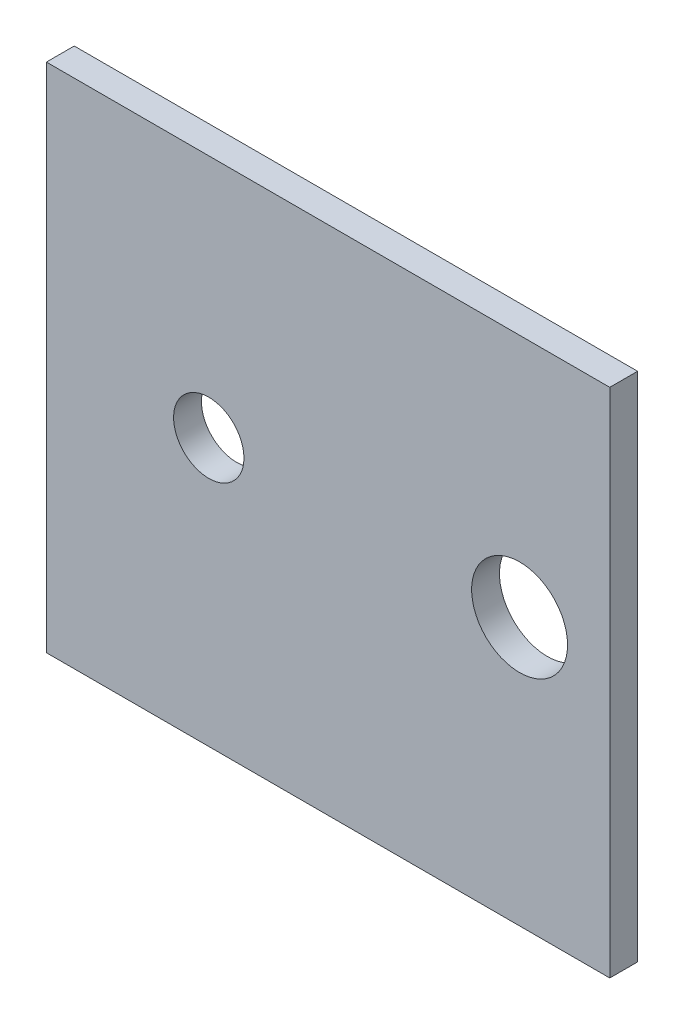
ISO-10303-21;
HEADER;
FILE_DESCRIPTION(('STEP AP214'),'2;1');
FILE_NAME('part.step','',(''),(''),'','','');
FILE_SCHEMA(('AUTOMOTIVE_DESIGN { 1 0 10303 214 1 1 1 1 }'));
ENDSEC;
DATA;
#1=APPLICATION_CONTEXT('core data for automotive mechanical design processes');
#2=APPLICATION_PROTOCOL_DEFINITION('international standard','automotive_design',2000,#1);
#3=PRODUCT_CONTEXT('',#1,'mechanical');
#4=PRODUCT('Part','Part','',(#3));
#5=PRODUCT_RELATED_PRODUCT_CATEGORY('part','',(#4));
#6=PRODUCT_DEFINITION_FORMATION('','',#4);
#7=PRODUCT_DEFINITION_CONTEXT('part definition',#1,'design');
#8=PRODUCT_DEFINITION('design','',#6,#7);
#9=PRODUCT_DEFINITION_SHAPE('','',#8);
#10=(LENGTH_UNIT() NAMED_UNIT(*) SI_UNIT(.MILLI.,.METRE.));
#11=(NAMED_UNIT(*) PLANE_ANGLE_UNIT() SI_UNIT($,.RADIAN.));
#12=(NAMED_UNIT(*) SI_UNIT($,.STERADIAN.) SOLID_ANGLE_UNIT());
#13=UNCERTAINTY_MEASURE_WITH_UNIT(LENGTH_MEASURE(1.E-05),#10,'distance_accuracy_value','');
#14=(GEOMETRIC_REPRESENTATION_CONTEXT(3) GLOBAL_UNCERTAINTY_ASSIGNED_CONTEXT((#13)) GLOBAL_UNIT_ASSIGNED_CONTEXT((#10,
#11,#12)) REPRESENTATION_CONTEXT('',''));
#15=CARTESIAN_POINT('',(0.,0.,0.));
#16=DIRECTION('',(0.,0.,1.));
#17=DIRECTION('',(1.,0.,0.));
#18=AXIS2_PLACEMENT_3D('',#15,#16,#17);
#19=CARTESIAN_POINT('',(-54.8277353652689,48.1512235817575,4.35));
#20=DIRECTION('',(1.,0.,0.));
#21=DIRECTION('',(0.,1.,0.));
#22=AXIS2_PLACEMENT_3D('',#19,#20,#21);
#23=PLANE('',#22);
#24=DIRECTION('',(0.,-1.,0.));
#25=VECTOR('',#24,1.);
#26=CARTESIAN_POINT('',(-54.8277353652689,48.1512235817575,0.));
#27=LINE('',#26,#25);
#28=CARTESIAN_POINT('',(-54.8277353652689,48.1512235817575,0.));
#29=VERTEX_POINT('',#28);
#30=CARTESIAN_POINT('',(-54.8277353652689,-31.8487764182425,0.));
#31=VERTEX_POINT('',#30);
#32=EDGE_CURVE('E107',#29,#31,#27,.T.);
#33=ORIENTED_EDGE('',*,*,#32,.T.);
#34=DIRECTION('',(0.,0.,-1.));
#35=VECTOR('',#34,1.);
#36=CARTESIAN_POINT('',(-54.8277353652689,-31.8487764182425,4.35));
#37=LINE('',#36,#35);
#38=CARTESIAN_POINT('',(-54.8277353652689,-31.8487764182425,4.35));
#39=VERTEX_POINT('',#38);
#40=EDGE_CURVE('E11',#39,#31,#37,.T.);
#41=ORIENTED_EDGE('',*,*,#40,.F.);
#42=DIRECTION('',(0.,-1.,0.));
#43=VECTOR('',#42,1.);
#44=CARTESIAN_POINT('',(-54.8277353652689,48.1512235817575,4.35));
#45=LINE('',#44,#43);
#46=CARTESIAN_POINT('',(-54.8277353652689,48.1512235817575,4.35));
#47=VERTEX_POINT('',#46);
#48=EDGE_CURVE('E91',#47,#39,#45,.T.);
#49=ORIENTED_EDGE('',*,*,#48,.F.);
#50=DIRECTION('',(0.,0.,-1.));
#51=VECTOR('',#50,1.);
#52=CARTESIAN_POINT('',(-54.8277353652689,48.1512235817575,4.35));
#53=LINE('',#52,#51);
#54=EDGE_CURVE('E103',#47,#29,#53,.T.);
#55=ORIENTED_EDGE('',*,*,#54,.T.);
#56=EDGE_LOOP('',(#33,#41,#49,#55));
#57=FACE_BOUND('',#56,.T.);
#58=ADVANCED_FACE('F39',(#57),#23,.F.);
#59=CARTESIAN_POINT('',(-54.8277353652689,-31.8487764182425,4.35));
#60=DIRECTION('',(0.,1.,0.));
#61=DIRECTION('',(0.,0.,1.));
#62=AXIS2_PLACEMENT_3D('',#59,#60,#61);
#63=PLANE('',#62);
#64=DIRECTION('',(1.,0.,0.));
#65=VECTOR('',#64,1.);
#66=CARTESIAN_POINT('',(-54.8277353652689,-31.8487764182425,0.));
#67=LINE('',#66,#65);
#68=CARTESIAN_POINT('',(33.2722646347311,-31.8487764182425,0.));
#69=VERTEX_POINT('',#68);
#70=EDGE_CURVE('E96',#31,#69,#67,.T.);
#71=ORIENTED_EDGE('',*,*,#70,.T.);
#72=DIRECTION('',(0.,0.,-1.));
#73=VECTOR('',#72,1.);
#74=CARTESIAN_POINT('',(33.2722646347311,-31.8487764182425,4.35));
#75=LINE('',#74,#73);
#76=CARTESIAN_POINT('',(33.2722646347311,-31.8487764182425,4.35));
#77=VERTEX_POINT('',#76);
#78=EDGE_CURVE('E48',#77,#69,#75,.T.);
#79=ORIENTED_EDGE('',*,*,#78,.F.);
#80=DIRECTION('',(1.,0.,0.));
#81=VECTOR('',#80,1.);
#82=CARTESIAN_POINT('',(-54.8277353652689,-31.8487764182425,4.35));
#83=LINE('',#82,#81);
#84=EDGE_CURVE('E86',#39,#77,#83,.T.);
#85=ORIENTED_EDGE('',*,*,#84,.F.);
#86=ORIENTED_EDGE('',*,*,#40,.T.);
#87=EDGE_LOOP('',(#71,#79,#85,#86));
#88=FACE_BOUND('',#87,.T.);
#89=ADVANCED_FACE('F95',(#88),#63,.F.);
#90=CARTESIAN_POINT('',(33.2722646347311,48.1512235817575,4.35));
#91=DIRECTION('',(-1.,0.,0.));
#92=DIRECTION('',(0.,-1.,0.));
#93=AXIS2_PLACEMENT_3D('',#90,#91,#92);
#94=PLANE('',#93);
#95=DIRECTION('',(0.,1.,0.));
#96=VECTOR('',#95,1.);
#97=CARTESIAN_POINT('',(33.2722646347311,48.1512235817575,0.));
#98=LINE('',#97,#96);
#99=CARTESIAN_POINT('',(33.2722646347311,48.1512235817575,0.));
#100=VERTEX_POINT('',#99);
#101=EDGE_CURVE('E73',#69,#100,#98,.T.);
#102=ORIENTED_EDGE('',*,*,#101,.T.);
#103=DIRECTION('',(0.,0.,-1.));
#104=VECTOR('',#103,1.);
#105=CARTESIAN_POINT('',(33.2722646347311,48.1512235817575,4.35));
#106=LINE('',#105,#104);
#107=CARTESIAN_POINT('',(33.2722646347311,48.1512235817575,4.35));
#108=VERTEX_POINT('',#107);
#109=EDGE_CURVE('E98',#108,#100,#106,.T.);
#110=ORIENTED_EDGE('',*,*,#109,.F.);
#111=DIRECTION('',(0.,1.,0.));
#112=VECTOR('',#111,1.);
#113=CARTESIAN_POINT('',(33.2722646347311,48.1512235817575,4.35));
#114=LINE('',#113,#112);
#115=EDGE_CURVE('E89',#77,#108,#114,.T.);
#116=ORIENTED_EDGE('',*,*,#115,.F.);
#117=ORIENTED_EDGE('',*,*,#78,.T.);
#118=EDGE_LOOP('',(#102,#110,#116,#117));
#119=FACE_BOUND('',#118,.T.);
#120=ADVANCED_FACE('F99',(#119),#94,.F.);
#121=CARTESIAN_POINT('',(-54.8277353652689,48.1512235817575,4.35));
#122=DIRECTION('',(0.,-1.,0.));
#123=DIRECTION('',(0.,0.,-1.));
#124=AXIS2_PLACEMENT_3D('',#121,#122,#123);
#125=PLANE('',#124);
#126=DIRECTION('',(-1.,0.,0.));
#127=VECTOR('',#126,1.);
#128=CARTESIAN_POINT('',(-54.8277353652689,48.1512235817575,0.));
#129=LINE('',#128,#127);
#130=EDGE_CURVE('E79',#100,#29,#129,.T.);
#131=ORIENTED_EDGE('',*,*,#130,.T.);
#132=ORIENTED_EDGE('',*,*,#54,.F.);
#133=DIRECTION('',(-1.,0.,0.));
#134=VECTOR('',#133,1.);
#135=CARTESIAN_POINT('',(-54.8277353652689,48.1512235817575,4.35));
#136=LINE('',#135,#134);
#137=EDGE_CURVE('E56',#108,#47,#136,.T.);
#138=ORIENTED_EDGE('',*,*,#137,.F.);
#139=ORIENTED_EDGE('',*,*,#109,.T.);
#140=EDGE_LOOP('',(#131,#132,#138,#139));
#141=FACE_BOUND('',#140,.T.);
#142=ADVANCED_FACE('F121',(#141),#125,.F.);
#143=CARTESIAN_POINT('',(0.,0.,4.35));
#144=DIRECTION('',(0.,0.,1.));
#145=DIRECTION('',(1.,0.,0.));
#146=AXIS2_PLACEMENT_3D('',#143,#144,#145);
#147=PLANE('',#146);
#148=CARTESIAN_POINT('',(19.1722646347311,9.96122358175752,4.35));
#149=DIRECTION('',(0.,0.,1.));
#150=DIRECTION('',(1.,0.,0.));
#151=AXIS2_PLACEMENT_3D('',#148,#149,#150);
#152=CIRCLE('',#151,7.5);
#153=CARTESIAN_POINT('',(26.6722646347311,9.96122358175752,4.35));
#154=VERTEX_POINT('',#153);
#155=EDGE_CURVE('E136',#154,#154,#152,.T.);
#156=ORIENTED_EDGE('',*,*,#155,.F.);
#157=EDGE_LOOP('',(#156));
#158=FACE_BOUND('',#157,.T.);
#159=CARTESIAN_POINT('',(-29.4377353652689,9.96122358175752,4.35));
#160=DIRECTION('',(0.,0.,1.));
#161=DIRECTION('',(1.,0.,0.));
#162=AXIS2_PLACEMENT_3D('',#159,#160,#161);
#163=CIRCLE('',#162,5.5);
#164=CARTESIAN_POINT('',(-23.9377353652689,9.96122358175752,4.35));
#165=VERTEX_POINT('',#164);
#166=EDGE_CURVE('E128',#165,#165,#163,.T.);
#167=ORIENTED_EDGE('',*,*,#166,.F.);
#168=EDGE_LOOP('',(#167));
#169=FACE_BOUND('',#168,.T.);
#170=ORIENTED_EDGE('',*,*,#48,.T.);
#171=ORIENTED_EDGE('',*,*,#84,.T.);
#172=ORIENTED_EDGE('',*,*,#115,.T.);
#173=ORIENTED_EDGE('',*,*,#137,.T.);
#174=EDGE_LOOP('',(#170,#171,#172,#173));
#175=FACE_BOUND('',#174,.T.);
#176=ADVANCED_FACE('F87',(#158,#169,#175),#147,.T.);
#177=CARTESIAN_POINT('',(0.,0.,0.));
#178=DIRECTION('',(0.,0.,1.));
#179=DIRECTION('',(1.,0.,0.));
#180=AXIS2_PLACEMENT_3D('',#177,#178,#179);
#181=PLANE('',#180);
#182=CARTESIAN_POINT('',(19.1722646347311,9.96122358175752,0.));
#183=DIRECTION('',(0.,0.,1.));
#184=DIRECTION('',(1.,0.,0.));
#185=AXIS2_PLACEMENT_3D('',#182,#183,#184);
#186=CIRCLE('',#185,7.5);
#187=CARTESIAN_POINT('',(26.6722646347311,9.96122358175752,0.));
#188=VERTEX_POINT('',#187);
#189=EDGE_CURVE('E111',#188,#188,#186,.T.);
#190=ORIENTED_EDGE('',*,*,#189,.T.);
#191=EDGE_LOOP('',(#190));
#192=FACE_BOUND('',#191,.T.);
#193=CARTESIAN_POINT('',(-29.4377353652689,9.96122358175752,0.));
#194=DIRECTION('',(0.,0.,1.));
#195=DIRECTION('',(1.,0.,0.));
#196=AXIS2_PLACEMENT_3D('',#193,#194,#195);
#197=CIRCLE('',#196,5.5);
#198=CARTESIAN_POINT('',(-23.9377353652689,9.96122358175752,0.));
#199=VERTEX_POINT('',#198);
#200=EDGE_CURVE('E132',#199,#199,#197,.T.);
#201=ORIENTED_EDGE('',*,*,#200,.T.);
#202=EDGE_LOOP('',(#201));
#203=FACE_BOUND('',#202,.T.);
#204=ORIENTED_EDGE('',*,*,#32,.F.);
#205=ORIENTED_EDGE('',*,*,#130,.F.);
#206=ORIENTED_EDGE('',*,*,#101,.F.);
#207=ORIENTED_EDGE('',*,*,#70,.F.);
#208=EDGE_LOOP('',(#204,#205,#206,#207));
#209=FACE_BOUND('',#208,.T.);
#210=ADVANCED_FACE('F124',(#192,#203,#209),#181,.F.);
#211=CARTESIAN_POINT('',(-29.4377353652689,9.96122358175752,0.));
#212=DIRECTION('',(0.,0.,1.));
#213=DIRECTION('',(1.,0.,0.));
#214=AXIS2_PLACEMENT_3D('',#211,#212,#213);
#215=CYLINDRICAL_SURFACE('',#214,5.5);
#216=ORIENTED_EDGE('',*,*,#200,.F.);
#217=EDGE_LOOP('',(#216));
#218=FACE_BOUND('',#217,.T.);
#219=ORIENTED_EDGE('',*,*,#166,.T.);
#220=EDGE_LOOP('',(#219));
#221=FACE_BOUND('',#220,.T.);
#222=ADVANCED_FACE('F149',(#218,#221),#215,.F.);
#223=CARTESIAN_POINT('',(19.1722646347311,9.96122358175752,0.));
#224=DIRECTION('',(0.,0.,1.));
#225=DIRECTION('',(1.,0.,0.));
#226=AXIS2_PLACEMENT_3D('',#223,#224,#225);
#227=CYLINDRICAL_SURFACE('',#226,7.5);
#228=ORIENTED_EDGE('',*,*,#189,.F.);
#229=EDGE_LOOP('',(#228));
#230=FACE_BOUND('',#229,.T.);
#231=ORIENTED_EDGE('',*,*,#155,.T.);
#232=EDGE_LOOP('',(#231));
#233=FACE_BOUND('',#232,.T.);
#234=ADVANCED_FACE('F146',(#230,#233),#227,.F.);
#235=CLOSED_SHELL('',(#58,#89,#120,#142,#176,#210,#222,#234));
#236=MANIFOLD_SOLID_BREP('B2',#235);
#237=ADVANCED_BREP_SHAPE_REPRESENTATION('',(#18,#236),#14);
#238=SHAPE_DEFINITION_REPRESENTATION(#9,#237);
ENDSEC;
END-ISO-10303-21;
